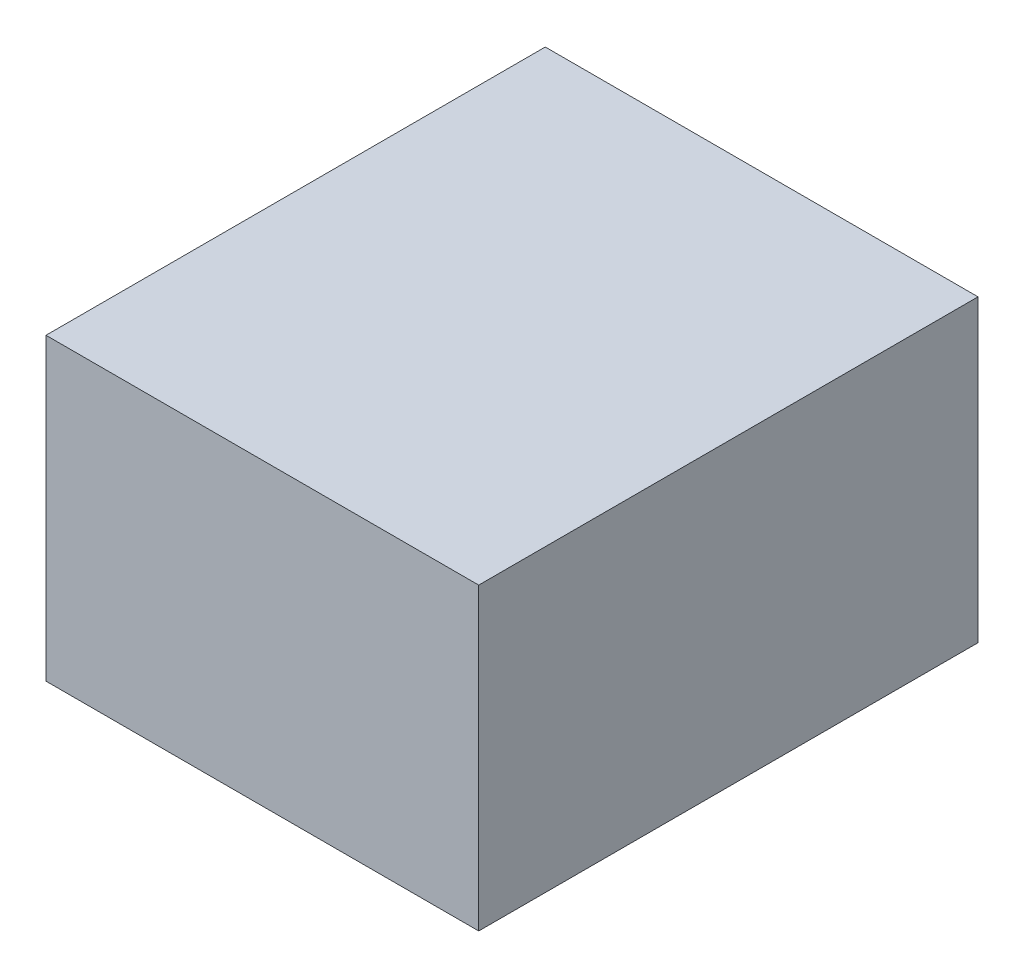
ISO-10303-21;
HEADER;
FILE_DESCRIPTION(('STEP AP214'),'2;1');
FILE_NAME('part.step','',(''),(''),'','','');
FILE_SCHEMA(('AUTOMOTIVE_DESIGN { 1 0 10303 214 1 1 1 1 }'));
ENDSEC;
DATA;
#1=APPLICATION_CONTEXT('core data for automotive mechanical design processes');
#2=APPLICATION_PROTOCOL_DEFINITION('international standard','automotive_design',2000,#1);
#3=PRODUCT_CONTEXT('',#1,'mechanical');
#4=PRODUCT('Part','Part','',(#3));
#5=PRODUCT_RELATED_PRODUCT_CATEGORY('part','',(#4));
#6=PRODUCT_DEFINITION_FORMATION('','',#4);
#7=PRODUCT_DEFINITION_CONTEXT('part definition',#1,'design');
#8=PRODUCT_DEFINITION('design','',#6,#7);
#9=PRODUCT_DEFINITION_SHAPE('','',#8);
#10=(LENGTH_UNIT() NAMED_UNIT(*) SI_UNIT(.MILLI.,.METRE.));
#11=(NAMED_UNIT(*) PLANE_ANGLE_UNIT() SI_UNIT($,.RADIAN.));
#12=(NAMED_UNIT(*) SI_UNIT($,.STERADIAN.) SOLID_ANGLE_UNIT());
#13=UNCERTAINTY_MEASURE_WITH_UNIT(LENGTH_MEASURE(1.E-05),#10,'distance_accuracy_value','');
#14=(GEOMETRIC_REPRESENTATION_CONTEXT(3) GLOBAL_UNCERTAINTY_ASSIGNED_CONTEXT((#13)) GLOBAL_UNIT_ASSIGNED_CONTEXT((#10,
#11,#12)) REPRESENTATION_CONTEXT('',''));
#15=CARTESIAN_POINT('',(0.,0.,0.));
#16=DIRECTION('',(0.,0.,1.));
#17=DIRECTION('',(1.,0.,0.));
#18=AXIS2_PLACEMENT_3D('',#15,#16,#17);
#19=CARTESIAN_POINT('',(0.,0.,381.));
#20=DIRECTION('',(1.,0.,0.));
#21=DIRECTION('',(0.,0.,-1.));
#22=AXIS2_PLACEMENT_3D('',#19,#20,#21);
#23=PLANE('',#22);
#24=DIRECTION('',(0.,-1.,0.));
#25=VECTOR('',#24,1.);
#26=CARTESIAN_POINT('',(0.,0.,0.));
#27=LINE('',#26,#25);
#28=CARTESIAN_POINT('',(0.,228.6,0.));
#29=VERTEX_POINT('',#28);
#30=CARTESIAN_POINT('',(0.,0.,0.));
#31=VERTEX_POINT('',#30);
#32=EDGE_CURVE('E99',#29,#31,#27,.T.);
#33=ORIENTED_EDGE('',*,*,#32,.T.);
#34=DIRECTION('',(0.,0.,-1.));
#35=VECTOR('',#34,1.);
#36=CARTESIAN_POINT('',(0.,0.,381.));
#37=LINE('',#36,#35);
#38=CARTESIAN_POINT('',(0.,0.,381.));
#39=VERTEX_POINT('',#38);
#40=EDGE_CURVE('E11',#39,#31,#37,.T.);
#41=ORIENTED_EDGE('',*,*,#40,.F.);
#42=DIRECTION('',(0.,-1.,0.));
#43=VECTOR('',#42,1.);
#44=CARTESIAN_POINT('',(0.,0.,381.));
#45=LINE('',#44,#43);
#46=CARTESIAN_POINT('',(0.,228.6,381.));
#47=VERTEX_POINT('',#46);
#48=EDGE_CURVE('E87',#47,#39,#45,.T.);
#49=ORIENTED_EDGE('',*,*,#48,.F.);
#50=DIRECTION('',(0.,0.,-1.));
#51=VECTOR('',#50,1.);
#52=CARTESIAN_POINT('',(0.,228.6,381.));
#53=LINE('',#52,#51);
#54=EDGE_CURVE('E95',#47,#29,#53,.T.);
#55=ORIENTED_EDGE('',*,*,#54,.T.);
#56=EDGE_LOOP('',(#33,#41,#49,#55));
#57=FACE_BOUND('',#56,.T.);
#58=ADVANCED_FACE('F36',(#57),#23,.F.);
#59=CARTESIAN_POINT('',(0.,0.,381.));
#60=DIRECTION('',(0.,1.,0.));
#61=DIRECTION('',(0.,0.,1.));
#62=AXIS2_PLACEMENT_3D('',#59,#60,#61);
#63=PLANE('',#62);
#64=DIRECTION('',(1.,0.,0.));
#65=VECTOR('',#64,1.);
#66=CARTESIAN_POINT('',(0.,0.,0.));
#67=LINE('',#66,#65);
#68=CARTESIAN_POINT('',(330.2,0.,0.));
#69=VERTEX_POINT('',#68);
#70=EDGE_CURVE('E91',#31,#69,#67,.T.);
#71=ORIENTED_EDGE('',*,*,#70,.T.);
#72=DIRECTION('',(0.,0.,-1.));
#73=VECTOR('',#72,1.);
#74=CARTESIAN_POINT('',(330.2,0.,381.));
#75=LINE('',#74,#73);
#76=CARTESIAN_POINT('',(330.2,0.,381.));
#77=VERTEX_POINT('',#76);
#78=EDGE_CURVE('E44',#77,#69,#75,.T.);
#79=ORIENTED_EDGE('',*,*,#78,.F.);
#80=DIRECTION('',(1.,0.,0.));
#81=VECTOR('',#80,1.);
#82=CARTESIAN_POINT('',(0.,0.,381.));
#83=LINE('',#82,#81);
#84=EDGE_CURVE('E82',#39,#77,#83,.T.);
#85=ORIENTED_EDGE('',*,*,#84,.F.);
#86=ORIENTED_EDGE('',*,*,#40,.T.);
#87=EDGE_LOOP('',(#71,#79,#85,#86));
#88=FACE_BOUND('',#87,.T.);
#89=ADVANCED_FACE('F90',(#88),#63,.F.);
#90=CARTESIAN_POINT('',(330.2,0.,381.));
#91=DIRECTION('',(-1.,0.,0.));
#92=DIRECTION('',(0.,0.,1.));
#93=AXIS2_PLACEMENT_3D('',#90,#91,#92);
#94=PLANE('',#93);
#95=DIRECTION('',(0.,1.,0.));
#96=VECTOR('',#95,1.);
#97=CARTESIAN_POINT('',(330.2,0.,0.));
#98=LINE('',#97,#96);
#99=CARTESIAN_POINT('',(330.2,228.6,0.));
#100=VERTEX_POINT('',#99);
#101=EDGE_CURVE('E69',#69,#100,#98,.T.);
#102=ORIENTED_EDGE('',*,*,#101,.T.);
#103=DIRECTION('',(0.,0.,-1.));
#104=VECTOR('',#103,1.);
#105=CARTESIAN_POINT('',(330.2,228.6,381.));
#106=LINE('',#105,#104);
#107=CARTESIAN_POINT('',(330.2,228.6,381.));
#108=VERTEX_POINT('',#107);
#109=EDGE_CURVE('E92',#108,#100,#106,.T.);
#110=ORIENTED_EDGE('',*,*,#109,.F.);
#111=DIRECTION('',(0.,1.,0.));
#112=VECTOR('',#111,1.);
#113=CARTESIAN_POINT('',(330.2,0.,381.));
#114=LINE('',#113,#112);
#115=EDGE_CURVE('E85',#77,#108,#114,.T.);
#116=ORIENTED_EDGE('',*,*,#115,.F.);
#117=ORIENTED_EDGE('',*,*,#78,.T.);
#118=EDGE_LOOP('',(#102,#110,#116,#117));
#119=FACE_BOUND('',#118,.T.);
#120=ADVANCED_FACE('F93',(#119),#94,.F.);
#121=CARTESIAN_POINT('',(0.,228.6,381.));
#122=DIRECTION('',(0.,-1.,0.));
#123=DIRECTION('',(0.,0.,-1.));
#124=AXIS2_PLACEMENT_3D('',#121,#122,#123);
#125=PLANE('',#124);
#126=DIRECTION('',(-1.,0.,0.));
#127=VECTOR('',#126,1.);
#128=CARTESIAN_POINT('',(0.,228.6,0.));
#129=LINE('',#128,#127);
#130=EDGE_CURVE('E75',#100,#29,#129,.T.);
#131=ORIENTED_EDGE('',*,*,#130,.T.);
#132=ORIENTED_EDGE('',*,*,#54,.F.);
#133=DIRECTION('',(-1.,0.,0.));
#134=VECTOR('',#133,1.);
#135=CARTESIAN_POINT('',(0.,228.6,381.));
#136=LINE('',#135,#134);
#137=EDGE_CURVE('E52',#108,#47,#136,.T.);
#138=ORIENTED_EDGE('',*,*,#137,.F.);
#139=ORIENTED_EDGE('',*,*,#109,.T.);
#140=EDGE_LOOP('',(#131,#132,#138,#139));
#141=FACE_BOUND('',#140,.T.);
#142=ADVANCED_FACE('F106',(#141),#125,.F.);
#143=CARTESIAN_POINT('',(0.,0.,381.));
#144=DIRECTION('',(0.,0.,-1.));
#145=DIRECTION('',(-1.,0.,0.));
#146=AXIS2_PLACEMENT_3D('',#143,#144,#145);
#147=PLANE('',#146);
#148=ORIENTED_EDGE('',*,*,#48,.T.);
#149=ORIENTED_EDGE('',*,*,#84,.T.);
#150=ORIENTED_EDGE('',*,*,#115,.T.);
#151=ORIENTED_EDGE('',*,*,#137,.T.);
#152=EDGE_LOOP('',(#148,#149,#150,#151));
#153=FACE_BOUND('',#152,.T.);
#154=ADVANCED_FACE('F83',(#153),#147,.F.);
#155=CARTESIAN_POINT('',(0.,0.,0.));
#156=DIRECTION('',(0.,0.,-1.));
#157=DIRECTION('',(-1.,0.,0.));
#158=AXIS2_PLACEMENT_3D('',#155,#156,#157);
#159=PLANE('',#158);
#160=ORIENTED_EDGE('',*,*,#32,.F.);
#161=ORIENTED_EDGE('',*,*,#130,.F.);
#162=ORIENTED_EDGE('',*,*,#101,.F.);
#163=ORIENTED_EDGE('',*,*,#70,.F.);
#164=EDGE_LOOP('',(#160,#161,#162,#163));
#165=FACE_BOUND('',#164,.T.);
#166=ADVANCED_FACE('F109',(#165),#159,.T.);
#167=CLOSED_SHELL('',(#58,#89,#120,#142,#154,#166));
#168=MANIFOLD_SOLID_BREP('B2',#167);
#169=ADVANCED_BREP_SHAPE_REPRESENTATION('',(#18,#168),#14);
#170=SHAPE_DEFINITION_REPRESENTATION(#9,#169);
ENDSEC;
END-ISO-10303-21;
